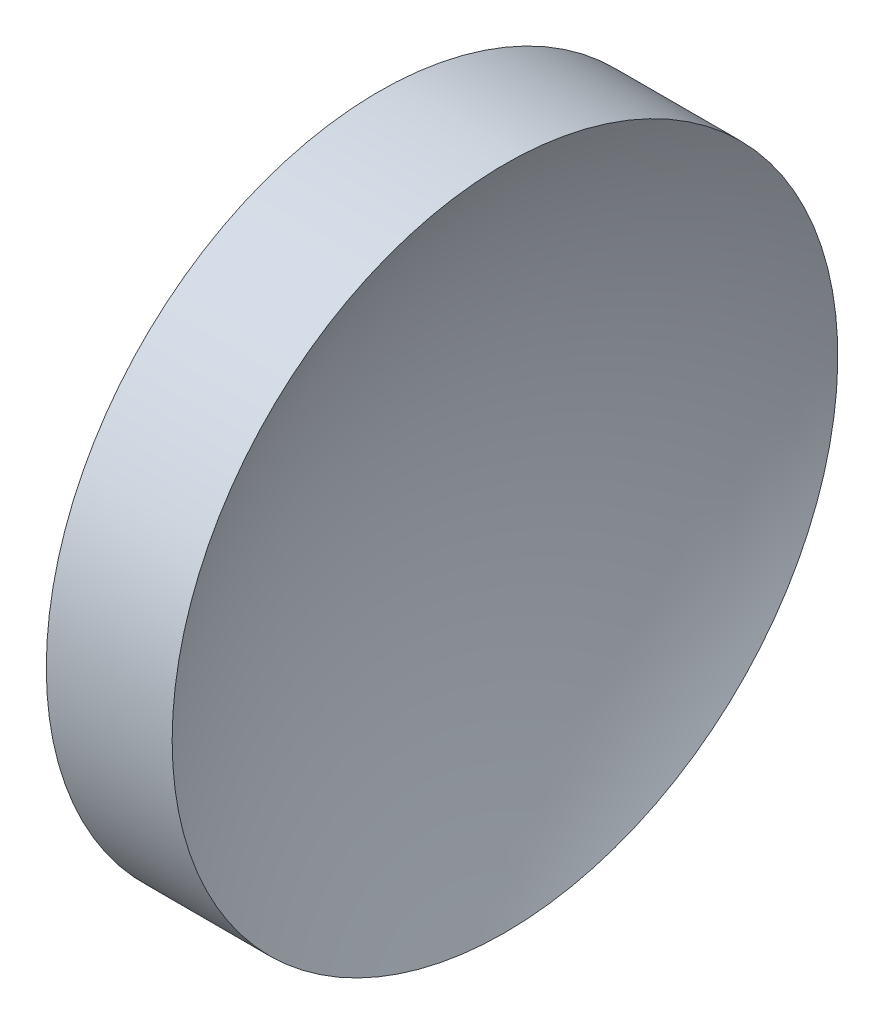
ISO-10303-21;
HEADER;
FILE_DESCRIPTION(('STEP AP214'),'2;1');
FILE_NAME('part.step','',(''),(''),'','','');
FILE_SCHEMA(('AUTOMOTIVE_DESIGN { 1 0 10303 214 1 1 1 1 }'));
ENDSEC;
DATA;
#1=APPLICATION_CONTEXT('core data for automotive mechanical design processes');
#2=APPLICATION_PROTOCOL_DEFINITION('international standard','automotive_design',2000,#1);
#3=PRODUCT_CONTEXT('',#1,'mechanical');
#4=PRODUCT('Part','Part','',(#3));
#5=PRODUCT_RELATED_PRODUCT_CATEGORY('part','',(#4));
#6=PRODUCT_DEFINITION_FORMATION('','',#4);
#7=PRODUCT_DEFINITION_CONTEXT('part definition',#1,'design');
#8=PRODUCT_DEFINITION('design','',#6,#7);
#9=PRODUCT_DEFINITION_SHAPE('','',#8);
#10=(LENGTH_UNIT() NAMED_UNIT(*) SI_UNIT(.MILLI.,.METRE.));
#11=(NAMED_UNIT(*) PLANE_ANGLE_UNIT() SI_UNIT($,.RADIAN.));
#12=(NAMED_UNIT(*) SI_UNIT($,.STERADIAN.) SOLID_ANGLE_UNIT());
#13=UNCERTAINTY_MEASURE_WITH_UNIT(LENGTH_MEASURE(1.E-05),#10,'distance_accuracy_value','');
#14=(GEOMETRIC_REPRESENTATION_CONTEXT(3) GLOBAL_UNCERTAINTY_ASSIGNED_CONTEXT((#13)) GLOBAL_UNIT_ASSIGNED_CONTEXT((#10,
#11,#12)) REPRESENTATION_CONTEXT('',''));
#15=CARTESIAN_POINT('',(0.,0.,0.));
#16=DIRECTION('',(0.,0.,1.));
#17=DIRECTION('',(1.,0.,0.));
#18=AXIS2_PLACEMENT_3D('',#15,#16,#17);
#19=CARTESIAN_POINT('',(168.379437134643,65.1556304570152,0.));
#20=DIRECTION('',(-1.,0.,0.));
#21=DIRECTION('',(0.,-1.,0.));
#22=AXIS2_PLACEMENT_3D('',#19,#20,#21);
#23=SPHERICAL_SURFACE('',#22,51.64);
#24=CARTESIAN_POINT('',(123.19437765698,65.1556304570152,0.));
#25=DIRECTION('',(-1.,0.,0.));
#26=DIRECTION('',(0.,0.,1.));
#27=AXIS2_PLACEMENT_3D('',#24,#25,#26);
#28=CIRCLE('',#27,25.);
#29=CARTESIAN_POINT('',(123.19437765698,65.1556304570152,25.));
#30=VERTEX_POINT('',#29);
#31=EDGE_CURVE('E10',#30,#30,#28,.T.);
#32=ORIENTED_EDGE('',*,*,#31,.F.);
#33=EDGE_LOOP('',(#32));
#34=FACE_BOUND('',#33,.T.);
#35=ADVANCED_FACE('F35',(#34),#23,.F.);
#36=CARTESIAN_POINT('',(105.62183712383,65.1556304570152,0.));
#37=DIRECTION('',(-1.,0.,0.));
#38=DIRECTION('',(0.,0.,1.));
#39=AXIS2_PLACEMENT_3D('',#36,#37,#38);
#40=CYLINDRICAL_SURFACE('',#39,25.);
#41=CARTESIAN_POINT('',(113.739437134643,65.1556304570152,0.));
#42=DIRECTION('',(-1.,0.,0.));
#43=DIRECTION('',(0.,0.,1.));
#44=AXIS2_PLACEMENT_3D('',#41,#42,#43);
#45=CIRCLE('',#44,25.);
#46=CARTESIAN_POINT('',(113.739437134643,65.1556304570152,25.));
#47=VERTEX_POINT('',#46);
#48=EDGE_CURVE('E41',#47,#47,#45,.T.);
#49=ORIENTED_EDGE('',*,*,#48,.F.);
#50=EDGE_LOOP('',(#49));
#51=FACE_BOUND('',#50,.T.);
#52=ORIENTED_EDGE('',*,*,#31,.T.);
#53=EDGE_LOOP('',(#52));
#54=FACE_BOUND('',#53,.T.);
#55=ADVANCED_FACE('F49',(#51,#54),#40,.T.);
#56=CARTESIAN_POINT('',(113.739437134643,65.1556304570152,0.));
#57=DIRECTION('',(1.,0.,0.));
#58=DIRECTION('',(0.,0.,-1.));
#59=AXIS2_PLACEMENT_3D('',#56,#57,#58);
#60=PLANE('',#59);
#61=ORIENTED_EDGE('',*,*,#48,.T.);
#62=EDGE_LOOP('',(#61));
#63=FACE_BOUND('',#62,.T.);
#64=ADVANCED_FACE('F47',(#63),#60,.F.);
#65=CLOSED_SHELL('',(#35,#55,#64));
#66=MANIFOLD_SOLID_BREP('B2',#65);
#67=ADVANCED_BREP_SHAPE_REPRESENTATION('',(#18,#66),#14);
#68=SHAPE_DEFINITION_REPRESENTATION(#9,#67);
ENDSEC;
END-ISO-10303-21;
